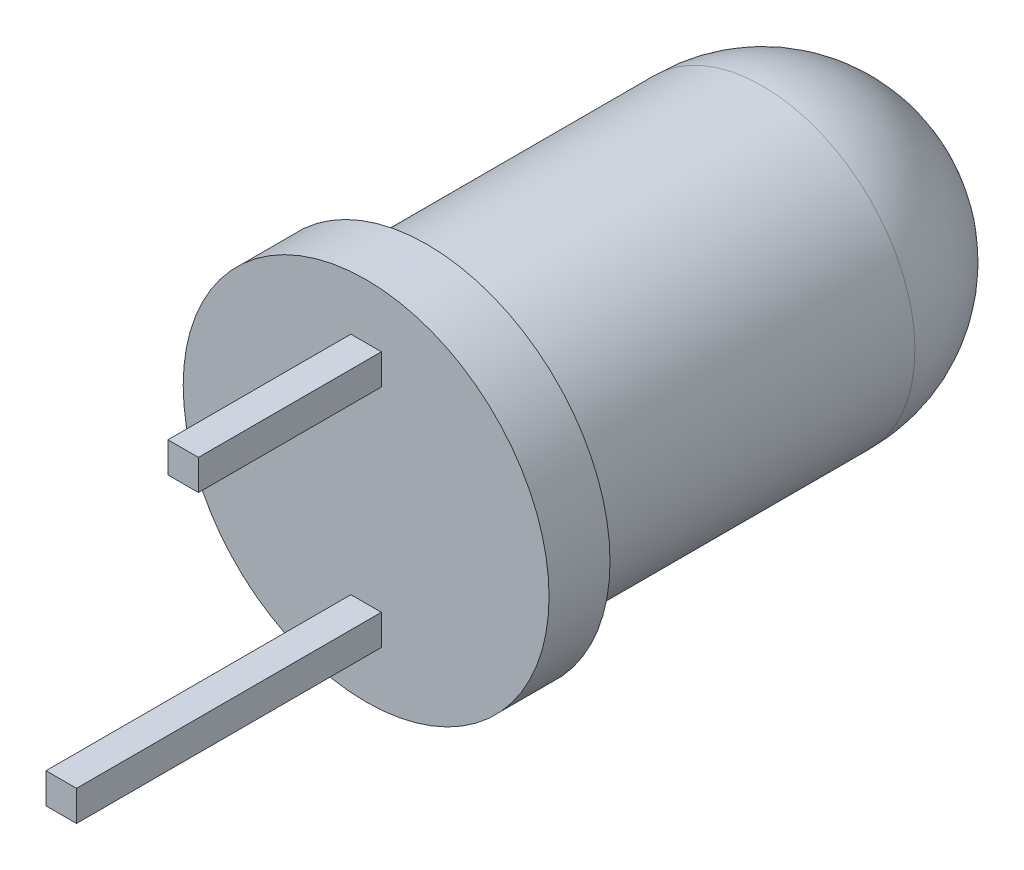
ISO-10303-21;
HEADER;
FILE_DESCRIPTION(('STEP AP214'),'2;1');
FILE_NAME('part.step','',(''),(''),'','','');
FILE_SCHEMA(('AUTOMOTIVE_DESIGN { 1 0 10303 214 1 1 1 1 }'));
ENDSEC;
DATA;
#1=APPLICATION_CONTEXT('core data for automotive mechanical design processes');
#2=APPLICATION_PROTOCOL_DEFINITION('international standard','automotive_design',2000,#1);
#3=PRODUCT_CONTEXT('',#1,'mechanical');
#4=PRODUCT('Part','Part','',(#3));
#5=PRODUCT_RELATED_PRODUCT_CATEGORY('part','',(#4));
#6=PRODUCT_DEFINITION_FORMATION('','',#4);
#7=PRODUCT_DEFINITION_CONTEXT('part definition',#1,'design');
#8=PRODUCT_DEFINITION('design','',#6,#7);
#9=PRODUCT_DEFINITION_SHAPE('','',#8);
#10=(LENGTH_UNIT() NAMED_UNIT(*) SI_UNIT(.MILLI.,.METRE.));
#11=(NAMED_UNIT(*) PLANE_ANGLE_UNIT() SI_UNIT($,.RADIAN.));
#12=(NAMED_UNIT(*) SI_UNIT($,.STERADIAN.) SOLID_ANGLE_UNIT());
#13=UNCERTAINTY_MEASURE_WITH_UNIT(LENGTH_MEASURE(1.E-05),#10,'distance_accuracy_value','');
#14=(GEOMETRIC_REPRESENTATION_CONTEXT(3) GLOBAL_UNCERTAINTY_ASSIGNED_CONTEXT((#13)) GLOBAL_UNIT_ASSIGNED_CONTEXT((#10,
#11,#12)) REPRESENTATION_CONTEXT('',''));
#15=CARTESIAN_POINT('',(0.,0.,0.));
#16=DIRECTION('',(0.,0.,1.));
#17=DIRECTION('',(1.,0.,0.));
#18=AXIS2_PLACEMENT_3D('',#15,#16,#17);
#19=CARTESIAN_POINT('',(-0.25,-1.6,3.));
#20=DIRECTION('',(0.,-1.,0.));
#21=DIRECTION('',(1.,0.,0.));
#22=AXIS2_PLACEMENT_3D('',#19,#20,#21);
#23=PLANE('',#22);
#24=DIRECTION('',(-1.,0.,0.));
#25=VECTOR('',#24,1.);
#26=CARTESIAN_POINT('',(-0.25,-1.6,0.));
#27=LINE('',#26,#25);
#28=CARTESIAN_POINT('',(0.25,-1.6,0.));
#29=VERTEX_POINT('',#28);
#30=CARTESIAN_POINT('',(-0.25,-1.6,0.));
#31=VERTEX_POINT('',#30);
#32=EDGE_CURVE('E118',#29,#31,#27,.T.);
#33=ORIENTED_EDGE('',*,*,#32,.T.);
#34=DIRECTION('',(0.,0.,-1.));
#35=VECTOR('',#34,1.);
#36=CARTESIAN_POINT('',(-0.25,-1.6,3.));
#37=LINE('',#36,#35);
#38=CARTESIAN_POINT('',(-0.25,-1.6,5.));
#39=VERTEX_POINT('',#38);
#40=EDGE_CURVE('E12',#39,#31,#37,.T.);
#41=ORIENTED_EDGE('',*,*,#40,.F.);
#42=DIRECTION('',(-1.,0.,0.));
#43=VECTOR('',#42,1.);
#44=CARTESIAN_POINT('',(0.25,-1.6,5.));
#45=LINE('',#44,#43);
#46=CARTESIAN_POINT('',(0.25,-1.6,5.));
#47=VERTEX_POINT('',#46);
#48=EDGE_CURVE('E104',#47,#39,#45,.T.);
#49=ORIENTED_EDGE('',*,*,#48,.F.);
#50=DIRECTION('',(0.,0.,-1.));
#51=VECTOR('',#50,1.);
#52=CARTESIAN_POINT('',(0.25,-1.6,3.));
#53=LINE('',#52,#51);
#54=EDGE_CURVE('E93',#47,#29,#53,.T.);
#55=ORIENTED_EDGE('',*,*,#54,.T.);
#56=EDGE_LOOP('',(#33,#41,#49,#55));
#57=FACE_BOUND('',#56,.T.);
#58=ADVANCED_FACE('F54',(#57),#23,.F.);
#59=CARTESIAN_POINT('',(-0.25,-1.6,3.));
#60=DIRECTION('',(1.,0.,0.));
#61=DIRECTION('',(0.,1.,0.));
#62=AXIS2_PLACEMENT_3D('',#59,#60,#61);
#63=PLANE('',#62);
#64=DIRECTION('',(0.,-1.,0.));
#65=VECTOR('',#64,1.);
#66=CARTESIAN_POINT('',(-0.25,-1.6,0.));
#67=LINE('',#66,#65);
#68=CARTESIAN_POINT('',(-0.25,-2.1,0.));
#69=VERTEX_POINT('',#68);
#70=EDGE_CURVE('E120',#31,#69,#67,.T.);
#71=ORIENTED_EDGE('',*,*,#70,.T.);
#72=DIRECTION('',(0.,0.,-1.));
#73=VECTOR('',#72,1.);
#74=CARTESIAN_POINT('',(-0.25,-2.1,3.));
#75=LINE('',#74,#73);
#76=CARTESIAN_POINT('',(-0.25,-2.1,5.));
#77=VERTEX_POINT('',#76);
#78=EDGE_CURVE('E61',#77,#69,#75,.T.);
#79=ORIENTED_EDGE('',*,*,#78,.F.);
#80=DIRECTION('',(0.,-1.,0.));
#81=VECTOR('',#80,1.);
#82=CARTESIAN_POINT('',(-0.25,-1.6,5.));
#83=LINE('',#82,#81);
#84=EDGE_CURVE('E108',#39,#77,#83,.T.);
#85=ORIENTED_EDGE('',*,*,#84,.F.);
#86=ORIENTED_EDGE('',*,*,#40,.T.);
#87=EDGE_LOOP('',(#71,#79,#85,#86));
#88=FACE_BOUND('',#87,.T.);
#89=ADVANCED_FACE('F128',(#88),#63,.F.);
#90=CARTESIAN_POINT('',(-0.25,-2.1,3.));
#91=DIRECTION('',(0.,1.,0.));
#92=DIRECTION('',(0.,0.,1.));
#93=AXIS2_PLACEMENT_3D('',#90,#91,#92);
#94=PLANE('',#93);
#95=DIRECTION('',(1.,0.,0.));
#96=VECTOR('',#95,1.);
#97=CARTESIAN_POINT('',(-0.25,-2.1,0.));
#98=LINE('',#97,#96);
#99=CARTESIAN_POINT('',(0.249999999999999,-2.1,0.));
#100=VERTEX_POINT('',#99);
#101=EDGE_CURVE('E76',#69,#100,#98,.T.);
#102=ORIENTED_EDGE('',*,*,#101,.T.);
#103=DIRECTION('',(0.,0.,-1.));
#104=VECTOR('',#103,1.);
#105=CARTESIAN_POINT('',(0.249999999999999,-2.1,3.));
#106=LINE('',#105,#104);
#107=CARTESIAN_POINT('',(0.249999999999999,-2.1,5.));
#108=VERTEX_POINT('',#107);
#109=EDGE_CURVE('E101',#108,#100,#106,.T.);
#110=ORIENTED_EDGE('',*,*,#109,.F.);
#111=DIRECTION('',(1.,0.,0.));
#112=VECTOR('',#111,1.);
#113=CARTESIAN_POINT('',(-0.25,-2.1,5.));
#114=LINE('',#113,#112);
#115=EDGE_CURVE('E113',#77,#108,#114,.T.);
#116=ORIENTED_EDGE('',*,*,#115,.F.);
#117=ORIENTED_EDGE('',*,*,#78,.T.);
#118=EDGE_LOOP('',(#102,#110,#116,#117));
#119=FACE_BOUND('',#118,.T.);
#120=ADVANCED_FACE('F124',(#119),#94,.F.);
#121=CARTESIAN_POINT('',(0.25,-1.6,3.));
#122=DIRECTION('',(-1.,0.,0.));
#123=DIRECTION('',(0.,-1.,0.));
#124=AXIS2_PLACEMENT_3D('',#121,#122,#123);
#125=PLANE('',#124);
#126=DIRECTION('',(0.,1.,0.));
#127=VECTOR('',#126,1.);
#128=CARTESIAN_POINT('',(0.25,-1.6,0.));
#129=LINE('',#128,#127);
#130=EDGE_CURVE('E68',#100,#29,#129,.T.);
#131=ORIENTED_EDGE('',*,*,#130,.T.);
#132=ORIENTED_EDGE('',*,*,#54,.F.);
#133=DIRECTION('',(0.,1.,0.));
#134=VECTOR('',#133,1.);
#135=CARTESIAN_POINT('',(0.249999999999999,-2.1,5.));
#136=LINE('',#135,#134);
#137=EDGE_CURVE('E97',#108,#47,#136,.T.);
#138=ORIENTED_EDGE('',*,*,#137,.F.);
#139=ORIENTED_EDGE('',*,*,#109,.T.);
#140=EDGE_LOOP('',(#131,#132,#138,#139));
#141=FACE_BOUND('',#140,.T.);
#142=ADVANCED_FACE('F95',(#141),#125,.F.);
#143=CARTESIAN_POINT('',(0.,0.,0.));
#144=DIRECTION('',(0.,0.,-1.));
#145=DIRECTION('',(-1.,0.,0.));
#146=AXIS2_PLACEMENT_3D('',#143,#144,#145);
#147=PLANE('',#146);
#148=ORIENTED_EDGE('',*,*,#32,.F.);
#149=ORIENTED_EDGE('',*,*,#130,.F.);
#150=ORIENTED_EDGE('',*,*,#101,.F.);
#151=ORIENTED_EDGE('',*,*,#70,.F.);
#152=EDGE_LOOP('',(#148,#149,#150,#151));
#153=FACE_BOUND('',#152,.T.);
#154=ADVANCED_FACE('F127',(#153),#147,.T.);
#155=CARTESIAN_POINT('',(0.,0.,5.));
#156=DIRECTION('',(0.,0.,1.));
#157=DIRECTION('',(1.,0.,0.));
#158=AXIS2_PLACEMENT_3D('',#155,#156,#157);
#159=PLANE('',#158);
#160=ORIENTED_EDGE('',*,*,#137,.T.);
#161=ORIENTED_EDGE('',*,*,#48,.T.);
#162=ORIENTED_EDGE('',*,*,#84,.T.);
#163=ORIENTED_EDGE('',*,*,#115,.T.);
#164=EDGE_LOOP('',(#160,#161,#162,#163));
#165=FACE_BOUND('',#164,.T.);
#166=ADVANCED_FACE('F111',(#165),#159,.T.);
#167=CLOSED_SHELL('',(#58,#89,#120,#142,#154,#166));
#168=MANIFOLD_SOLID_BREP('B2',#167);
#169=CARTESIAN_POINT('',(-0.25,1.6,3.));
#170=DIRECTION('',(1.,0.,0.));
#171=DIRECTION('',(0.,1.,0.));
#172=AXIS2_PLACEMENT_3D('',#169,#170,#171);
#173=PLANE('',#172);
#174=DIRECTION('',(0.,-1.,0.));
#175=VECTOR('',#174,1.);
#176=CARTESIAN_POINT('',(-0.25,1.6,0.));
#177=LINE('',#176,#175);
#178=CARTESIAN_POINT('',(-0.25,2.1,0.));
#179=VERTEX_POINT('',#178);
#180=CARTESIAN_POINT('',(-0.25,1.6,0.));
#181=VERTEX_POINT('',#180);
#182=EDGE_CURVE('E265',#179,#181,#177,.T.);
#183=ORIENTED_EDGE('',*,*,#182,.T.);
#184=DIRECTION('',(0.,0.,-1.));
#185=VECTOR('',#184,1.);
#186=CARTESIAN_POINT('',(-0.25,1.6,3.));
#187=LINE('',#186,#185);
#188=CARTESIAN_POINT('',(-0.25,1.6,3.));
#189=VERTEX_POINT('',#188);
#190=EDGE_CURVE('E52',#189,#181,#187,.T.);
#191=ORIENTED_EDGE('',*,*,#190,.F.);
#192=DIRECTION('',(0.,-1.,0.));
#193=VECTOR('',#192,1.);
#194=CARTESIAN_POINT('',(-0.25,1.6,3.));
#195=LINE('',#194,#193);
#196=CARTESIAN_POINT('',(-0.25,2.1,3.));
#197=VERTEX_POINT('',#196);
#198=EDGE_CURVE('E253',#197,#189,#195,.T.);
#199=ORIENTED_EDGE('',*,*,#198,.F.);
#200=DIRECTION('',(0.,0.,-1.));
#201=VECTOR('',#200,1.);
#202=CARTESIAN_POINT('',(-0.25,2.1,3.));
#203=LINE('',#202,#201);
#204=EDGE_CURVE('E261',#197,#179,#203,.T.);
#205=ORIENTED_EDGE('',*,*,#204,.T.);
#206=EDGE_LOOP('',(#183,#191,#199,#205));
#207=FACE_BOUND('',#206,.T.);
#208=ADVANCED_FACE('F202',(#207),#173,.F.);
#209=CARTESIAN_POINT('',(-0.25,1.6,3.));
#210=DIRECTION('',(0.,1.,0.));
#211=DIRECTION('',(-1.,0.,0.));
#212=AXIS2_PLACEMENT_3D('',#209,#210,#211);
#213=PLANE('',#212);
#214=DIRECTION('',(1.,0.,0.));
#215=VECTOR('',#214,1.);
#216=CARTESIAN_POINT('',(-0.25,1.6,0.));
#217=LINE('',#216,#215);
#218=CARTESIAN_POINT('',(0.25,1.6,0.));
#219=VERTEX_POINT('',#218);
#220=EDGE_CURVE('E257',#181,#219,#217,.T.);
#221=ORIENTED_EDGE('',*,*,#220,.T.);
#222=DIRECTION('',(0.,0.,-1.));
#223=VECTOR('',#222,1.);
#224=CARTESIAN_POINT('',(0.25,1.6,3.));
#225=LINE('',#224,#223);
#226=CARTESIAN_POINT('',(0.25,1.6,3.));
#227=VERTEX_POINT('',#226);
#228=EDGE_CURVE('E210',#227,#219,#225,.T.);
#229=ORIENTED_EDGE('',*,*,#228,.F.);
#230=DIRECTION('',(1.,0.,0.));
#231=VECTOR('',#230,1.);
#232=CARTESIAN_POINT('',(-0.25,1.6,3.));
#233=LINE('',#232,#231);
#234=EDGE_CURVE('E248',#189,#227,#233,.T.);
#235=ORIENTED_EDGE('',*,*,#234,.F.);
#236=ORIENTED_EDGE('',*,*,#190,.T.);
#237=EDGE_LOOP('',(#221,#229,#235,#236));
#238=FACE_BOUND('',#237,.T.);
#239=ADVANCED_FACE('F256',(#238),#213,.F.);
#240=CARTESIAN_POINT('',(0.25,1.6,3.));
#241=DIRECTION('',(-1.,0.,0.));
#242=DIRECTION('',(0.,-1.,0.));
#243=AXIS2_PLACEMENT_3D('',#240,#241,#242);
#244=PLANE('',#243);
#245=DIRECTION('',(0.,1.,0.));
#246=VECTOR('',#245,1.);
#247=CARTESIAN_POINT('',(0.25,1.6,0.));
#248=LINE('',#247,#246);
#249=CARTESIAN_POINT('',(0.25,2.1,0.));
#250=VERTEX_POINT('',#249);
#251=EDGE_CURVE('E235',#219,#250,#248,.T.);
#252=ORIENTED_EDGE('',*,*,#251,.T.);
#253=DIRECTION('',(0.,0.,-1.));
#254=VECTOR('',#253,1.);
#255=CARTESIAN_POINT('',(0.25,2.1,3.));
#256=LINE('',#255,#254);
#257=CARTESIAN_POINT('',(0.25,2.1,3.));
#258=VERTEX_POINT('',#257);
#259=EDGE_CURVE('E258',#258,#250,#256,.T.);
#260=ORIENTED_EDGE('',*,*,#259,.F.);
#261=DIRECTION('',(0.,1.,0.));
#262=VECTOR('',#261,1.);
#263=CARTESIAN_POINT('',(0.25,1.6,3.));
#264=LINE('',#263,#262);
#265=EDGE_CURVE('E251',#227,#258,#264,.T.);
#266=ORIENTED_EDGE('',*,*,#265,.F.);
#267=ORIENTED_EDGE('',*,*,#228,.T.);
#268=EDGE_LOOP('',(#252,#260,#266,#267));
#269=FACE_BOUND('',#268,.T.);
#270=ADVANCED_FACE('F259',(#269),#244,.F.);
#271=CARTESIAN_POINT('',(-0.25,2.1,3.));
#272=DIRECTION('',(0.,-1.,0.));
#273=DIRECTION('',(0.,0.,-1.));
#274=AXIS2_PLACEMENT_3D('',#271,#272,#273);
#275=PLANE('',#274);
#276=DIRECTION('',(-1.,0.,0.));
#277=VECTOR('',#276,1.);
#278=CARTESIAN_POINT('',(-0.25,2.1,0.));
#279=LINE('',#278,#277);
#280=EDGE_CURVE('E241',#250,#179,#279,.T.);
#281=ORIENTED_EDGE('',*,*,#280,.T.);
#282=ORIENTED_EDGE('',*,*,#204,.F.);
#283=DIRECTION('',(-1.,0.,0.));
#284=VECTOR('',#283,1.);
#285=CARTESIAN_POINT('',(-0.25,2.1,3.));
#286=LINE('',#285,#284);
#287=EDGE_CURVE('E218',#258,#197,#286,.T.);
#288=ORIENTED_EDGE('',*,*,#287,.F.);
#289=ORIENTED_EDGE('',*,*,#259,.T.);
#290=EDGE_LOOP('',(#281,#282,#288,#289));
#291=FACE_BOUND('',#290,.T.);
#292=ADVANCED_FACE('F272',(#291),#275,.F.);
#293=CARTESIAN_POINT('',(0.,0.,3.));
#294=DIRECTION('',(0.,0.,-1.));
#295=DIRECTION('',(-1.,0.,0.));
#296=AXIS2_PLACEMENT_3D('',#293,#294,#295);
#297=PLANE('',#296);
#298=ORIENTED_EDGE('',*,*,#198,.T.);
#299=ORIENTED_EDGE('',*,*,#234,.T.);
#300=ORIENTED_EDGE('',*,*,#265,.T.);
#301=ORIENTED_EDGE('',*,*,#287,.T.);
#302=EDGE_LOOP('',(#298,#299,#300,#301));
#303=FACE_BOUND('',#302,.T.);
#304=ADVANCED_FACE('F249',(#303),#297,.F.);
#305=CARTESIAN_POINT('',(0.,0.,0.));
#306=DIRECTION('',(0.,0.,-1.));
#307=DIRECTION('',(-1.,0.,0.));
#308=AXIS2_PLACEMENT_3D('',#305,#306,#307);
#309=PLANE('',#308);
#310=ORIENTED_EDGE('',*,*,#182,.F.);
#311=ORIENTED_EDGE('',*,*,#280,.F.);
#312=ORIENTED_EDGE('',*,*,#251,.F.);
#313=ORIENTED_EDGE('',*,*,#220,.F.);
#314=EDGE_LOOP('',(#310,#311,#312,#313));
#315=FACE_BOUND('',#314,.T.);
#316=ADVANCED_FACE('F275',(#315),#309,.T.);
#317=CLOSED_SHELL('',(#208,#239,#270,#292,#304,#316));
#318=MANIFOLD_SOLID_BREP('B6',#317);
#319=CARTESIAN_POINT('',(0.,0.,0.));
#320=DIRECTION('',(0.,0.,1.));
#321=DIRECTION('',(0.,-1.,0.));
#322=AXIS2_PLACEMENT_3D('',#319,#320,#321);
#323=PLANE('',#322);
#324=CARTESIAN_POINT('',(0.,0.,0.));
#325=DIRECTION('',(0.,0.,-1.));
#326=DIRECTION('',(0.,1.,0.));
#327=AXIS2_PLACEMENT_3D('',#324,#325,#326);
#328=CIRCLE('',#327,3.);
#329=CARTESIAN_POINT('',(0.,3.,0.));
#330=VERTEX_POINT('',#329);
#331=EDGE_CURVE('E332',#330,#330,#328,.T.);
#332=ORIENTED_EDGE('',*,*,#331,.F.);
#333=EDGE_LOOP('',(#332));
#334=FACE_BOUND('',#333,.T.);
#335=ADVANCED_FACE('F325',(#334),#323,.T.);
#336=CARTESIAN_POINT('',(0.,0.,-9.));
#337=DIRECTION('',(0.,0.,-1.));
#338=DIRECTION('',(0.,1.,0.));
#339=AXIS2_PLACEMENT_3D('',#336,#337,#338);
#340=CYLINDRICAL_SURFACE('',#339,3.);
#341=ORIENTED_EDGE('',*,*,#331,.T.);
#342=EDGE_LOOP('',(#341));
#343=FACE_BOUND('',#342,.T.);
#344=CARTESIAN_POINT('',(0.,0.,-1.));
#345=DIRECTION('',(0.,0.,-1.));
#346=DIRECTION('',(0.,1.,0.));
#347=AXIS2_PLACEMENT_3D('',#344,#345,#346);
#348=CIRCLE('',#347,3.);
#349=CARTESIAN_POINT('',(0.,3.,-1.));
#350=VERTEX_POINT('',#349);
#351=EDGE_CURVE('E336',#350,#350,#348,.T.);
#352=ORIENTED_EDGE('',*,*,#351,.F.);
#353=EDGE_LOOP('',(#352));
#354=FACE_BOUND('',#353,.T.);
#355=ADVANCED_FACE('F350',(#343,#354),#340,.T.);
#356=CARTESIAN_POINT('',(0.,3.,-1.));
#357=DIRECTION('',(0.,0.,-1.));
#358=DIRECTION('',(0.,1.,0.));
#359=AXIS2_PLACEMENT_3D('',#356,#357,#358);
#360=PLANE('',#359);
#361=ORIENTED_EDGE('',*,*,#351,.T.);
#362=EDGE_LOOP('',(#361));
#363=FACE_BOUND('',#362,.T.);
#364=CARTESIAN_POINT('',(0.,0.,-1.));
#365=DIRECTION('',(0.,0.,-1.));
#366=DIRECTION('',(0.,1.,0.));
#367=AXIS2_PLACEMENT_3D('',#364,#365,#366);
#368=CIRCLE('',#367,2.5);
#369=CARTESIAN_POINT('',(0.,2.5,-1.));
#370=VERTEX_POINT('',#369);
#371=EDGE_CURVE('E340',#370,#370,#368,.T.);
#372=ORIENTED_EDGE('',*,*,#371,.F.);
#373=EDGE_LOOP('',(#372));
#374=FACE_BOUND('',#373,.T.);
#375=ADVANCED_FACE('F348',(#363,#374),#360,.T.);
#376=CARTESIAN_POINT('',(0.,0.,-9.));
#377=DIRECTION('',(0.,0.,-1.));
#378=DIRECTION('',(0.,1.,0.));
#379=AXIS2_PLACEMENT_3D('',#376,#377,#378);
#380=CYLINDRICAL_SURFACE('',#379,2.5);
#381=CARTESIAN_POINT('',(0.,0.,-6.5));
#382=DIRECTION('',(0.,0.,-1.));
#383=DIRECTION('',(0.,1.,0.));
#384=AXIS2_PLACEMENT_3D('',#381,#382,#383);
#385=CIRCLE('',#384,2.5);
#386=CARTESIAN_POINT('',(0.,2.5,-6.5));
#387=VERTEX_POINT('',#386);
#388=EDGE_CURVE('E201',#387,#387,#385,.F.);
#389=ORIENTED_EDGE('',*,*,#388,.T.);
#390=EDGE_LOOP('',(#389));
#391=FACE_BOUND('',#390,.T.);
#392=ORIENTED_EDGE('',*,*,#371,.T.);
#393=EDGE_LOOP('',(#392));
#394=FACE_BOUND('',#393,.T.);
#395=ADVANCED_FACE('F346',(#391,#394),#380,.T.);
#396=CARTESIAN_POINT('',(0.,0.,-6.5));
#397=DIRECTION('',(0.,0.,1.));
#398=DIRECTION('',(1.,0.,0.));
#399=AXIS2_PLACEMENT_3D('',#396,#397,#398);
#400=SPHERICAL_SURFACE('',#399,2.5);
#401=ORIENTED_EDGE('',*,*,#388,.F.);
#402=EDGE_LOOP('',(#401));
#403=FACE_BOUND('',#402,.T.);
#404=ADVANCED_FACE('F327',(#403),#400,.T.);
#405=CLOSED_SHELL('',(#335,#355,#375,#395,#404));
#406=MANIFOLD_SOLID_BREP('B46',#405);
#407=ADVANCED_BREP_SHAPE_REPRESENTATION('',(#18,#168,#318,#406),#14);
#408=SHAPE_DEFINITION_REPRESENTATION(#9,#407);
ENDSEC;
END-ISO-10303-21;
